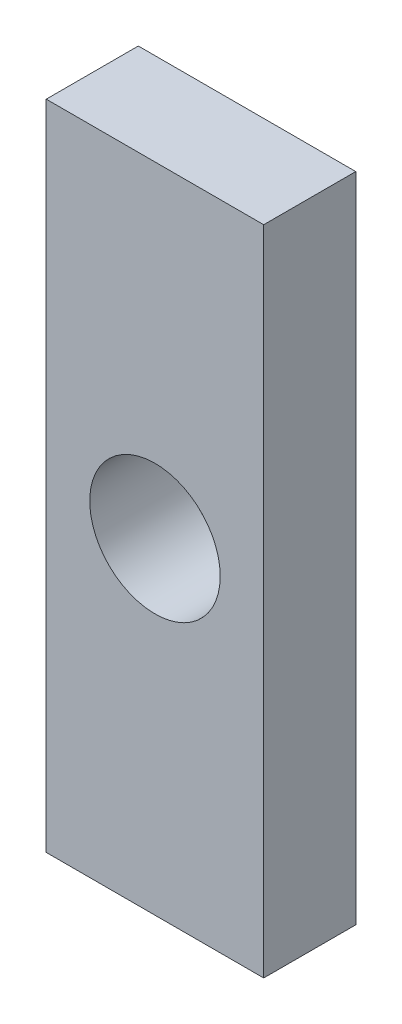
ISO-10303-21;
HEADER;
FILE_DESCRIPTION(('STEP AP214'),'2;1');
FILE_NAME('part.step','',(''),(''),'','','');
FILE_SCHEMA(('AUTOMOTIVE_DESIGN { 1 0 10303 214 1 1 1 1 }'));
ENDSEC;
DATA;
#1=APPLICATION_CONTEXT('core data for automotive mechanical design processes');
#2=APPLICATION_PROTOCOL_DEFINITION('international standard','automotive_design',2000,#1);
#3=PRODUCT_CONTEXT('',#1,'mechanical');
#4=PRODUCT('Part','Part','',(#3));
#5=PRODUCT_RELATED_PRODUCT_CATEGORY('part','',(#4));
#6=PRODUCT_DEFINITION_FORMATION('','',#4);
#7=PRODUCT_DEFINITION_CONTEXT('part definition',#1,'design');
#8=PRODUCT_DEFINITION('design','',#6,#7);
#9=PRODUCT_DEFINITION_SHAPE('','',#8);
#10=(LENGTH_UNIT() NAMED_UNIT(*) SI_UNIT(.MILLI.,.METRE.));
#11=(NAMED_UNIT(*) PLANE_ANGLE_UNIT() SI_UNIT($,.RADIAN.));
#12=(NAMED_UNIT(*) SI_UNIT($,.STERADIAN.) SOLID_ANGLE_UNIT());
#13=UNCERTAINTY_MEASURE_WITH_UNIT(LENGTH_MEASURE(1.E-05),#10,'distance_accuracy_value','');
#14=(GEOMETRIC_REPRESENTATION_CONTEXT(3) GLOBAL_UNCERTAINTY_ASSIGNED_CONTEXT((#13)) GLOBAL_UNIT_ASSIGNED_CONTEXT((#10,
#11,#12)) REPRESENTATION_CONTEXT('',''));
#15=CARTESIAN_POINT('',(0.,0.,0.));
#16=DIRECTION('',(0.,0.,1.));
#17=DIRECTION('',(1.,0.,0.));
#18=AXIS2_PLACEMENT_3D('',#15,#16,#17);
#19=CARTESIAN_POINT('',(0.,0.,6.35));
#20=DIRECTION('',(1.,0.,0.));
#21=DIRECTION('',(0.,0.,-1.));
#22=AXIS2_PLACEMENT_3D('',#19,#20,#21);
#23=PLANE('',#22);
#24=DIRECTION('',(0.,-1.,0.));
#25=VECTOR('',#24,1.);
#26=CARTESIAN_POINT('',(0.,0.,0.));
#27=LINE('',#26,#25);
#28=CARTESIAN_POINT('',(0.,45.,0.));
#29=VERTEX_POINT('',#28);
#30=CARTESIAN_POINT('',(0.,0.,0.));
#31=VERTEX_POINT('',#30);
#32=EDGE_CURVE('E107',#29,#31,#27,.T.);
#33=ORIENTED_EDGE('',*,*,#32,.T.);
#34=DIRECTION('',(0.,0.,-1.));
#35=VECTOR('',#34,1.);
#36=CARTESIAN_POINT('',(0.,0.,6.35));
#37=LINE('',#36,#35);
#38=CARTESIAN_POINT('',(0.,0.,6.35));
#39=VERTEX_POINT('',#38);
#40=EDGE_CURVE('E11',#39,#31,#37,.T.);
#41=ORIENTED_EDGE('',*,*,#40,.F.);
#42=DIRECTION('',(0.,-1.,0.));
#43=VECTOR('',#42,1.);
#44=CARTESIAN_POINT('',(0.,0.,6.35));
#45=LINE('',#44,#43);
#46=CARTESIAN_POINT('',(0.,45.,6.35));
#47=VERTEX_POINT('',#46);
#48=EDGE_CURVE('E91',#47,#39,#45,.T.);
#49=ORIENTED_EDGE('',*,*,#48,.F.);
#50=DIRECTION('',(0.,0.,-1.));
#51=VECTOR('',#50,1.);
#52=CARTESIAN_POINT('',(0.,45.,6.35));
#53=LINE('',#52,#51);
#54=EDGE_CURVE('E103',#47,#29,#53,.T.);
#55=ORIENTED_EDGE('',*,*,#54,.T.);
#56=EDGE_LOOP('',(#33,#41,#49,#55));
#57=FACE_BOUND('',#56,.T.);
#58=ADVANCED_FACE('F39',(#57),#23,.F.);
#59=CARTESIAN_POINT('',(0.,0.,6.35));
#60=DIRECTION('',(0.,1.,0.));
#61=DIRECTION('',(0.,0.,1.));
#62=AXIS2_PLACEMENT_3D('',#59,#60,#61);
#63=PLANE('',#62);
#64=DIRECTION('',(1.,0.,0.));
#65=VECTOR('',#64,1.);
#66=CARTESIAN_POINT('',(0.,0.,0.));
#67=LINE('',#66,#65);
#68=CARTESIAN_POINT('',(15.,0.,0.));
#69=VERTEX_POINT('',#68);
#70=EDGE_CURVE('E96',#31,#69,#67,.T.);
#71=ORIENTED_EDGE('',*,*,#70,.T.);
#72=DIRECTION('',(0.,0.,-1.));
#73=VECTOR('',#72,1.);
#74=CARTESIAN_POINT('',(15.,0.,6.35));
#75=LINE('',#74,#73);
#76=CARTESIAN_POINT('',(15.,0.,6.35));
#77=VERTEX_POINT('',#76);
#78=EDGE_CURVE('E48',#77,#69,#75,.T.);
#79=ORIENTED_EDGE('',*,*,#78,.F.);
#80=DIRECTION('',(1.,0.,0.));
#81=VECTOR('',#80,1.);
#82=CARTESIAN_POINT('',(0.,0.,6.35));
#83=LINE('',#82,#81);
#84=EDGE_CURVE('E86',#39,#77,#83,.T.);
#85=ORIENTED_EDGE('',*,*,#84,.F.);
#86=ORIENTED_EDGE('',*,*,#40,.T.);
#87=EDGE_LOOP('',(#71,#79,#85,#86));
#88=FACE_BOUND('',#87,.T.);
#89=ADVANCED_FACE('F95',(#88),#63,.F.);
#90=CARTESIAN_POINT('',(15.,0.,6.35));
#91=DIRECTION('',(-1.,0.,0.));
#92=DIRECTION('',(0.,0.,1.));
#93=AXIS2_PLACEMENT_3D('',#90,#91,#92);
#94=PLANE('',#93);
#95=DIRECTION('',(0.,1.,0.));
#96=VECTOR('',#95,1.);
#97=CARTESIAN_POINT('',(15.,0.,0.));
#98=LINE('',#97,#96);
#99=CARTESIAN_POINT('',(15.,45.,0.));
#100=VERTEX_POINT('',#99);
#101=EDGE_CURVE('E73',#69,#100,#98,.T.);
#102=ORIENTED_EDGE('',*,*,#101,.T.);
#103=DIRECTION('',(0.,0.,-1.));
#104=VECTOR('',#103,1.);
#105=CARTESIAN_POINT('',(15.,45.,6.35));
#106=LINE('',#105,#104);
#107=CARTESIAN_POINT('',(15.,45.,6.35));
#108=VERTEX_POINT('',#107);
#109=EDGE_CURVE('E98',#108,#100,#106,.T.);
#110=ORIENTED_EDGE('',*,*,#109,.F.);
#111=DIRECTION('',(0.,1.,0.));
#112=VECTOR('',#111,1.);
#113=CARTESIAN_POINT('',(15.,0.,6.35));
#114=LINE('',#113,#112);
#115=EDGE_CURVE('E89',#77,#108,#114,.T.);
#116=ORIENTED_EDGE('',*,*,#115,.F.);
#117=ORIENTED_EDGE('',*,*,#78,.T.);
#118=EDGE_LOOP('',(#102,#110,#116,#117));
#119=FACE_BOUND('',#118,.T.);
#120=ADVANCED_FACE('F99',(#119),#94,.F.);
#121=CARTESIAN_POINT('',(0.,45.,6.35));
#122=DIRECTION('',(0.,-1.,0.));
#123=DIRECTION('',(0.,0.,-1.));
#124=AXIS2_PLACEMENT_3D('',#121,#122,#123);
#125=PLANE('',#124);
#126=DIRECTION('',(-1.,0.,0.));
#127=VECTOR('',#126,1.);
#128=CARTESIAN_POINT('',(0.,45.,0.));
#129=LINE('',#128,#127);
#130=EDGE_CURVE('E79',#100,#29,#129,.T.);
#131=ORIENTED_EDGE('',*,*,#130,.T.);
#132=ORIENTED_EDGE('',*,*,#54,.F.);
#133=DIRECTION('',(-1.,0.,0.));
#134=VECTOR('',#133,1.);
#135=CARTESIAN_POINT('',(0.,45.,6.35));
#136=LINE('',#135,#134);
#137=EDGE_CURVE('E56',#108,#47,#136,.T.);
#138=ORIENTED_EDGE('',*,*,#137,.F.);
#139=ORIENTED_EDGE('',*,*,#109,.T.);
#140=EDGE_LOOP('',(#131,#132,#138,#139));
#141=FACE_BOUND('',#140,.T.);
#142=ADVANCED_FACE('F121',(#141),#125,.F.);
#143=CARTESIAN_POINT('',(0.,0.,6.35));
#144=DIRECTION('',(0.,0.,-1.));
#145=DIRECTION('',(-1.,0.,0.));
#146=AXIS2_PLACEMENT_3D('',#143,#144,#145);
#147=PLANE('',#146);
#148=CARTESIAN_POINT('',(7.5,22.5,6.35));
#149=DIRECTION('',(0.,0.,1.));
#150=DIRECTION('',(1.,0.,0.));
#151=AXIS2_PLACEMENT_3D('',#148,#149,#150);
#152=CIRCLE('',#151,4.5);
#153=CARTESIAN_POINT('',(12.,22.5,6.35));
#154=VERTEX_POINT('',#153);
#155=EDGE_CURVE('E128',#154,#154,#152,.T.);
#156=ORIENTED_EDGE('',*,*,#155,.F.);
#157=EDGE_LOOP('',(#156));
#158=FACE_BOUND('',#157,.T.);
#159=ORIENTED_EDGE('',*,*,#48,.T.);
#160=ORIENTED_EDGE('',*,*,#84,.T.);
#161=ORIENTED_EDGE('',*,*,#115,.T.);
#162=ORIENTED_EDGE('',*,*,#137,.T.);
#163=EDGE_LOOP('',(#159,#160,#161,#162));
#164=FACE_BOUND('',#163,.T.);
#165=ADVANCED_FACE('F87',(#158,#164),#147,.F.);
#166=CARTESIAN_POINT('',(0.,0.,0.));
#167=DIRECTION('',(0.,0.,-1.));
#168=DIRECTION('',(-1.,0.,0.));
#169=AXIS2_PLACEMENT_3D('',#166,#167,#168);
#170=PLANE('',#169);
#171=CARTESIAN_POINT('',(7.5,22.5,0.));
#172=DIRECTION('',(0.,0.,1.));
#173=DIRECTION('',(1.,0.,0.));
#174=AXIS2_PLACEMENT_3D('',#171,#172,#173);
#175=CIRCLE('',#174,4.5);
#176=CARTESIAN_POINT('',(12.,22.5,0.));
#177=VERTEX_POINT('',#176);
#178=EDGE_CURVE('E111',#177,#177,#175,.T.);
#179=ORIENTED_EDGE('',*,*,#178,.T.);
#180=EDGE_LOOP('',(#179));
#181=FACE_BOUND('',#180,.T.);
#182=ORIENTED_EDGE('',*,*,#32,.F.);
#183=ORIENTED_EDGE('',*,*,#130,.F.);
#184=ORIENTED_EDGE('',*,*,#101,.F.);
#185=ORIENTED_EDGE('',*,*,#70,.F.);
#186=EDGE_LOOP('',(#182,#183,#184,#185));
#187=FACE_BOUND('',#186,.T.);
#188=ADVANCED_FACE('F124',(#181,#187),#170,.T.);
#189=CARTESIAN_POINT('',(7.5,22.5,0.));
#190=DIRECTION('',(0.,0.,1.));
#191=DIRECTION('',(1.,0.,0.));
#192=AXIS2_PLACEMENT_3D('',#189,#190,#191);
#193=CYLINDRICAL_SURFACE('',#192,4.5);
#194=ORIENTED_EDGE('',*,*,#178,.F.);
#195=EDGE_LOOP('',(#194));
#196=FACE_BOUND('',#195,.T.);
#197=ORIENTED_EDGE('',*,*,#155,.T.);
#198=EDGE_LOOP('',(#197));
#199=FACE_BOUND('',#198,.T.);
#200=ADVANCED_FACE('F137',(#196,#199),#193,.F.);
#201=CLOSED_SHELL('',(#58,#89,#120,#142,#165,#188,#200));
#202=MANIFOLD_SOLID_BREP('B2',#201);
#203=ADVANCED_BREP_SHAPE_REPRESENTATION('',(#18,#202),#14);
#204=SHAPE_DEFINITION_REPRESENTATION(#9,#203);
ENDSEC;
END-ISO-10303-21;
